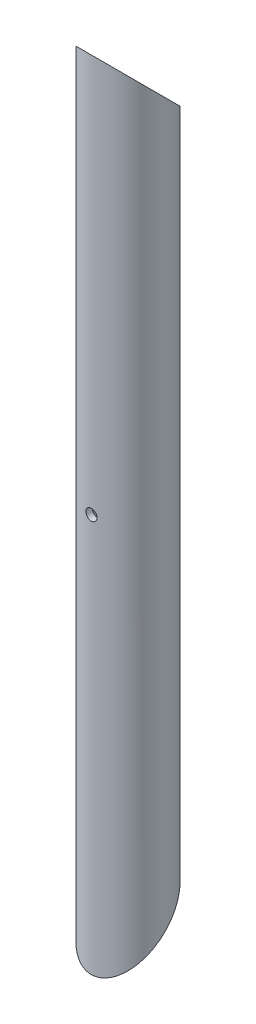
ISO-10303-21;
HEADER;
FILE_DESCRIPTION(('STEP AP214'),'2;1');
FILE_NAME('part.step','',(''),(''),'','','');
FILE_SCHEMA(('AUTOMOTIVE_DESIGN { 1 0 10303 214 1 1 1 1 }'));
ENDSEC;
DATA;
#1=APPLICATION_CONTEXT('core data for automotive mechanical design processes');
#2=APPLICATION_PROTOCOL_DEFINITION('international standard','automotive_design',2000,#1);
#3=PRODUCT_CONTEXT('',#1,'mechanical');
#4=PRODUCT('Part','Part','',(#3));
#5=PRODUCT_RELATED_PRODUCT_CATEGORY('part','',(#4));
#6=PRODUCT_DEFINITION_FORMATION('','',#4);
#7=PRODUCT_DEFINITION_CONTEXT('part definition',#1,'design');
#8=PRODUCT_DEFINITION('design','',#6,#7);
#9=PRODUCT_DEFINITION_SHAPE('','',#8);
#10=(LENGTH_UNIT() NAMED_UNIT(*) SI_UNIT(.MILLI.,.METRE.));
#11=(NAMED_UNIT(*) PLANE_ANGLE_UNIT() SI_UNIT($,.RADIAN.));
#12=(NAMED_UNIT(*) SI_UNIT($,.STERADIAN.) SOLID_ANGLE_UNIT());
#13=UNCERTAINTY_MEASURE_WITH_UNIT(LENGTH_MEASURE(1.E-05),#10,'distance_accuracy_value','');
#14=(GEOMETRIC_REPRESENTATION_CONTEXT(3) GLOBAL_UNCERTAINTY_ASSIGNED_CONTEXT((#13)) GLOBAL_UNIT_ASSIGNED_CONTEXT((#10,
#11,#12)) REPRESENTATION_CONTEXT('',''));
#15=CARTESIAN_POINT('',(0.,0.,0.));
#16=DIRECTION('',(0.,0.,1.));
#17=DIRECTION('',(1.,0.,0.));
#18=AXIS2_PLACEMENT_3D('',#15,#16,#17);
#19=CARTESIAN_POINT('',(0.,0.,25.328685172889));
#20=DIRECTION('',(0.,0.,-1.));
#21=DIRECTION('',(-1.,0.,0.));
#22=AXIS2_PLACEMENT_3D('',#19,#20,#21);
#23=CYLINDRICAL_SURFACE('',#22,3.175);
#24=CARTESIAN_POINT('',(-3.175,0.,-17.23601029821));
#25=CARTESIAN_POINT('',(-3.17499170563531,-0.176586329711993,-17.2360142025325));
#26=CARTESIAN_POINT('',(-3.160204980193,-0.353395647303662,-17.2387559605123));
#27=CARTESIAN_POINT('',(-3.10144620326743,-0.702172822919111,-17.2494221344825));
#28=CARTESIAN_POINT('',(-3.05741542075668,-0.874130210827916,-17.2573569793129));
#29=CARTESIAN_POINT('',(-2.94155418319512,-1.20790336169084,-17.2774814849624));
#30=CARTESIAN_POINT('',(-2.86976099295669,-1.36973238283411,-17.2896654401602));
#31=CARTESIAN_POINT('',(-2.70049958136209,-1.67898818960269,-17.3169076516439));
#32=CARTESIAN_POINT('',(-2.60304041137862,-1.82642002746643,-17.3319648941208));
#33=CARTESIAN_POINT('',(-2.38398457575559,-2.10449400464466,-17.3634567981395));
#34=CARTESIAN_POINT('',(-2.26214475966255,-2.23494319112389,-17.3799042842116));
#35=CARTESIAN_POINT('',(-1.9983060890961,-2.47367216439063,-17.4122106641685));
#36=CARTESIAN_POINT('',(-1.85630490149774,-2.5819493818351,-17.4280694896638));
#37=CARTESIAN_POINT('',(-1.5549329973674,-2.7739779431867,-17.4575458930296));
#38=CARTESIAN_POINT('',(-1.39544654247049,-2.85755041975943,-17.4711468271669));
#39=CARTESIAN_POINT('',(-1.06441137004706,-2.99664457625408,-17.4944334348895));
#40=CARTESIAN_POINT('',(-0.892863683139404,-3.05216864957038,-17.5041194425249));
#41=CARTESIAN_POINT('',(-0.544551877693409,-3.13300235226246,-17.5183953788483));
#42=CARTESIAN_POINT('',(-0.367864666154998,-3.15863364079218,-17.5230395218582));
#43=CARTESIAN_POINT('',(-0.0126405077397921,-3.17995577747868,-17.5268951402026));
#44=CARTESIAN_POINT('',(0.165896293571711,-3.17564896419808,-17.5261070398673));
#45=CARTESIAN_POINT('',(0.517545980754429,-3.13746523320548,-17.5192295190436));
#46=CARTESIAN_POINT('',(0.69069788570166,-3.10393485546927,-17.5132022283331));
#47=CARTESIAN_POINT('',(1.02887770129972,-3.00880264919223,-17.4965930267836));
#48=CARTESIAN_POINT('',(1.19390526609729,-2.94719962674158,-17.4860109222327));
#49=CARTESIAN_POINT('',(1.51216857737112,-2.79733388448749,-17.4613762385925));
#50=CARTESIAN_POINT('',(1.6653365929941,-2.70893044981589,-17.4473054148844));
#51=CARTESIAN_POINT('',(1.95478234852334,-2.50808391181308,-17.4172531348575));
#52=CARTESIAN_POINT('',(2.09105975689984,-2.3956403367387,-17.401271641048));
#53=CARTESIAN_POINT('',(2.34489710940459,-2.14801379502275,-17.3689022843395));
#54=CARTESIAN_POINT('',(2.4621651457909,-2.0125317791667,-17.352511870706));
#55=CARTESIAN_POINT('',(2.67240803396032,-1.7235970007153,-17.3213812233656));
#56=CARTESIAN_POINT('',(2.76537201617291,-1.57013624171481,-17.3066417296829));
#57=CARTESIAN_POINT('',(2.92443648471675,-1.24918627948011,-17.2804770196812));
#58=CARTESIAN_POINT('',(2.99047482913785,-1.0816656889827,-17.2690594873294));
#59=CARTESIAN_POINT('',(3.09325605413548,-0.737872419730787,-17.2509480784607));
#60=CARTESIAN_POINT('',(3.13006076603486,-0.561619055398518,-17.244244235605));
#61=CARTESIAN_POINT('',(3.15948139210758,-0.320051085290951,-17.2388627057127));
#62=CARTESIAN_POINT('',(3.16529604707456,-0.256192453007514,-17.2377954780037));
#63=CARTESIAN_POINT('',(3.17305685965037,-0.128232350837918,-17.236368564829));
#64=CARTESIAN_POINT('',(3.17500301226552,-0.0641308806383967,-17.2360088802766));
#65=CARTESIAN_POINT('',(3.17499170563531,0.176586329711993,-17.2360142025325));
#66=CARTESIAN_POINT('',(3.160204980193,0.353395647303662,-17.2387559605123));
#67=CARTESIAN_POINT('',(3.10144620326743,0.70217282291911,-17.2494221344825));
#68=CARTESIAN_POINT('',(3.05741542075668,0.874130210827915,-17.2573569793129));
#69=CARTESIAN_POINT('',(2.94155418319512,1.20790336169084,-17.2774814849624));
#70=CARTESIAN_POINT('',(2.86976099295669,1.36973238283411,-17.2896654401602));
#71=CARTESIAN_POINT('',(2.70049958136209,1.67898818960269,-17.3169076516439));
#72=CARTESIAN_POINT('',(2.60304041137862,1.82642002746643,-17.3319648941208));
#73=CARTESIAN_POINT('',(2.38398457575559,2.10449400464466,-17.3634567981395));
#74=CARTESIAN_POINT('',(2.26214475966255,2.23494319112389,-17.3799042842116));
#75=CARTESIAN_POINT('',(1.9983060890961,2.47367216439063,-17.4122106641685));
#76=CARTESIAN_POINT('',(1.85630490149774,2.5819493818351,-17.4280694896638));
#77=CARTESIAN_POINT('',(1.5549329973674,2.7739779431867,-17.4575458930296));
#78=CARTESIAN_POINT('',(1.39544654247049,2.85755041975943,-17.4711468271669));
#79=CARTESIAN_POINT('',(1.06441137004706,2.99664457625408,-17.4944334348895));
#80=CARTESIAN_POINT('',(0.892863683139404,3.05216864957038,-17.5041194425249));
#81=CARTESIAN_POINT('',(0.544551877693409,3.13300235226246,-17.5183953788483));
#82=CARTESIAN_POINT('',(0.367864666154998,3.15863364079218,-17.5230395218582));
#83=CARTESIAN_POINT('',(0.0126405077397924,3.17995577747868,-17.5268951402026));
#84=CARTESIAN_POINT('',(-0.165896293571711,3.17564896419808,-17.5261070398673));
#85=CARTESIAN_POINT('',(-0.517545980754429,3.13746523320548,-17.5192295190436));
#86=CARTESIAN_POINT('',(-0.690697885701659,3.10393485546927,-17.5132022283331));
#87=CARTESIAN_POINT('',(-1.02887770129972,3.00880264919223,-17.4965930267836));
#88=CARTESIAN_POINT('',(-1.19390526609729,2.94719962674158,-17.4860109222327));
#89=CARTESIAN_POINT('',(-1.51216857737112,2.79733388448749,-17.4613762385925));
#90=CARTESIAN_POINT('',(-1.6653365929941,2.70893044981589,-17.4473054148844));
#91=CARTESIAN_POINT('',(-1.95478234852334,2.50808391181308,-17.4172531348575));
#92=CARTESIAN_POINT('',(-2.09105975689984,2.3956403367387,-17.401271641048));
#93=CARTESIAN_POINT('',(-2.34489710940459,2.14801379502275,-17.3689022843395));
#94=CARTESIAN_POINT('',(-2.4621651457909,2.0125317791667,-17.352511870706));
#95=CARTESIAN_POINT('',(-2.67240803396032,1.7235970007153,-17.3213812233656));
#96=CARTESIAN_POINT('',(-2.76537201617291,1.57013624171481,-17.3066417296829));
#97=CARTESIAN_POINT('',(-2.92443648471675,1.24918627948012,-17.2804770196812));
#98=CARTESIAN_POINT('',(-2.99047482913785,1.0816656889827,-17.2690594873294));
#99=CARTESIAN_POINT('',(-3.09325605413548,0.737872419730787,-17.2509480784607));
#100=CARTESIAN_POINT('',(-3.13006076603486,0.561619055398519,-17.244244235605));
#101=CARTESIAN_POINT('',(-3.15948139210758,0.32005108529095,-17.2388627057127));
#102=CARTESIAN_POINT('',(-3.16529604707456,0.256192453007514,-17.2377954780037));
#103=CARTESIAN_POINT('',(-3.17305685965037,0.128232350837918,-17.236368564829));
#104=CARTESIAN_POINT('',(-3.17500301226552,0.0641308806383965,-17.2360088802766));
#105=CARTESIAN_POINT('',(-3.175,0.,-17.23601029821));
#106=B_SPLINE_CURVE_WITH_KNOTS('',3,(#24,#25,#26,#27,#28,#29,#30,#31,#32,#33,#34,#35,#36,#37,
#38,#39,#40,#41,#42,#43,#44,#45,#46,#47,#48,#49,#50,#51,#52,#53,#54,#55,#56,#57,#58,#59,#60,#61,
#62,#63,#64,#65,#66,#67,#68,#69,#70,#71,#72,#73,#74,#75,#76,#77,#78,#79,#80,#81,#82,#83,#84,#85,
#86,#87,#88,#89,#90,#91,#92,#93,#94,#95,#96,#97,#98,#99,#100,#101,#102,#103,#104,#105),
.UNSPECIFIED.,.T.,.F.,(4,2,2,2,2,2,2,2,2,2,2,2,2,2,2,2,2,2,2,2,2,2,2,2,2,2,2,2,2,2,2,2,2,2,2,2,
2,2,2,2,4),(0.,0.529513888774739,1.0600944322977,1.58996524863779,2.11964945021935,
2.65490616569006,3.19022487298483,3.72932945830094,4.26838803358483,4.8015909687849,
5.33475225423544,5.86167590853889,6.38862197462633,6.91838413625488,7.44815669443773,
7.98542013207565,8.52292344208854,9.06166033290218,9.59925469781341,9.79155807836205,
9.98386170714674,10.5133755959215,11.0439561394444,11.5738269557845,12.1035111573661,
12.6387678728368,13.1740865801316,13.7131911654477,14.2522497407316,14.7854526759316,
15.3186139613822,15.8455376156856,16.3724836817731,16.9022458434016,17.4320184015845,
17.9692818392224,18.5067851492353,19.0455220400489,19.5831164049602,19.7754197855088,
19.9677234142935),.UNSPECIFIED.);
#107=CARTESIAN_POINT('',(-3.175,0.,-17.23601029821));
#108=VERTEX_POINT('',#107);
#109=EDGE_CURVE('E18',#108,#108,#106,.T.);
#110=ORIENTED_EDGE('',*,*,#109,.T.);
#111=EDGE_LOOP('',(#110));
#112=FACE_BOUND('',#111,.T.);
#113=CARTESIAN_POINT('',(3.175,0.,-20.8415474233561));
#114=CARTESIAN_POINT('',(3.17499198153614,0.177084018009693,-20.841550570963));
#115=CARTESIAN_POINT('',(3.16012244295638,0.354396605066482,-20.8438306663304));
#116=CARTESIAN_POINT('',(3.10101874080881,0.704192750806675,-20.8527040450184));
#117=CARTESIAN_POINT('',(3.05672431568941,0.87666564082655,-20.85930617938));
#118=CARTESIAN_POINT('',(2.94012163446245,1.21147677341699,-20.876059336013));
#119=CARTESIAN_POINT('',(2.86784653303954,1.37382674741245,-20.886206156753));
#120=CARTESIAN_POINT('',(2.69740599554678,1.6840261412223,-20.9088995414036));
#121=CARTESIAN_POINT('',(2.59925063787972,1.83188117503907,-20.9214451706382));
#122=CARTESIAN_POINT('',(2.37896968509168,2.11017717524291,-20.947639110701));
#123=CARTESIAN_POINT('',(2.25667392977481,2.24048278519243,-20.9612948191984));
#124=CARTESIAN_POINT('',(1.99194559724344,2.47881081823414,-20.9881047967098));
#125=CARTESIAN_POINT('',(1.84951088719048,2.58683087816676,-21.0012590124251));
#126=CARTESIAN_POINT('',(1.5477002624607,2.77800435774252,-21.0256591780941));
#127=CARTESIAN_POINT('',(1.38824594400147,2.86103531695666,-21.0368956172459));
#128=CARTESIAN_POINT('',(1.05745854217628,2.99908665846758,-21.0561136072835));
#129=CARTESIAN_POINT('',(0.886126195416483,3.05410877594737,-21.0640953597952));
#130=CARTESIAN_POINT('',(0.537819507579906,3.13417697021133,-21.07585334209));
#131=CARTESIAN_POINT('',(0.36089761922799,3.15944654588681,-21.0796609129062));
#132=CARTESIAN_POINT('',(0.00528635041266461,3.17998633890252,-21.0827489482678));
#133=CARTESIAN_POINT('',(-0.173402933515662,3.1752581857816,-21.0820296587217));
#134=CARTESIAN_POINT('',(-0.525949789310128,3.13611312249602,-21.076170060675));
#135=CARTESIAN_POINT('',(-0.699834769386914,3.10193692691584,-21.0710655985168));
#136=CARTESIAN_POINT('',(-1.03937474503867,3.00524329517621,-21.0570490788488));
#137=CARTESIAN_POINT('',(-1.20502945779485,2.94272488583236,-21.048136890594));
#138=CARTESIAN_POINT('',(-1.52413828061928,2.79087293143009,-21.0274443893832));
#139=CARTESIAN_POINT('',(-1.67754305142225,2.70143724767826,-21.015653184629));
#140=CARTESIAN_POINT('',(-1.96724611548321,2.49837158811199,-20.9905178852117));
#141=CARTESIAN_POINT('',(-2.10354461967399,2.3847419106738,-20.9771738097005));
#142=CARTESIAN_POINT('',(-2.35657505297964,2.13519564150819,-20.9502662585847));
#143=CARTESIAN_POINT('',(-2.47310374178558,1.9990729975376,-20.9367019114556));
#144=CARTESIAN_POINT('',(-2.68174901209259,1.70902531345366,-20.9110027940947));
#145=CARTESIAN_POINT('',(-2.7738545302352,1.55509225066124,-20.8988686731134));
#146=CARTESIAN_POINT('',(-2.93105862601613,1.23353931809687,-20.8774028453063));
#147=CARTESIAN_POINT('',(-2.99611389281517,1.06589800925963,-20.8680756392477));
#148=CARTESIAN_POINT('',(-3.09695534061537,0.722119803337998,-20.8533505483862));
#149=CARTESIAN_POINT('',(-3.13280341719517,0.546001714013523,-20.8479443568951));
#150=CARTESIAN_POINT('',(-3.16070559060224,0.307196959759597,-20.8437206395775));
#151=CARTESIAN_POINT('',(-3.16606178486996,0.245890519962392,-20.8429074334073));
#152=CARTESIAN_POINT('',(-3.17321038429624,0.123065256838801,-20.8418202781168));
#153=CARTESIAN_POINT('',(-3.17500278685709,0.0615464333576373,-20.8415463293896));
#154=CARTESIAN_POINT('',(-3.17499198153614,-0.177084018009693,-20.841550570963));
#155=CARTESIAN_POINT('',(-3.16012244295638,-0.354396605066482,-20.8438306663304));
#156=CARTESIAN_POINT('',(-3.10101874080881,-0.704192750806674,-20.8527040450184));
#157=CARTESIAN_POINT('',(-3.05672431568941,-0.876665640826549,-20.85930617938));
#158=CARTESIAN_POINT('',(-2.94012163446245,-1.21147677341699,-20.876059336013));
#159=CARTESIAN_POINT('',(-2.86784653303954,-1.37382674741245,-20.886206156753));
#160=CARTESIAN_POINT('',(-2.69740599554678,-1.6840261412223,-20.9088995414036));
#161=CARTESIAN_POINT('',(-2.59925063787972,-1.83188117503907,-20.9214451706382));
#162=CARTESIAN_POINT('',(-2.37896968509168,-2.11017717524291,-20.947639110701));
#163=CARTESIAN_POINT('',(-2.25667392977481,-2.24048278519243,-20.9612948191984));
#164=CARTESIAN_POINT('',(-1.99194559724344,-2.47881081823414,-20.9881047967098));
#165=CARTESIAN_POINT('',(-1.84951088719048,-2.58683087816676,-21.0012590124251));
#166=CARTESIAN_POINT('',(-1.5477002624607,-2.77800435774252,-21.0256591780941));
#167=CARTESIAN_POINT('',(-1.38824594400147,-2.86103531695666,-21.0368956172459));
#168=CARTESIAN_POINT('',(-1.05745854217628,-2.99908665846758,-21.0561136072835));
#169=CARTESIAN_POINT('',(-0.886126195416483,-3.05410877594737,-21.0640953597952));
#170=CARTESIAN_POINT('',(-0.537819507579906,-3.13417697021133,-21.07585334209));
#171=CARTESIAN_POINT('',(-0.36089761922799,-3.15944654588681,-21.0796609129062));
#172=CARTESIAN_POINT('',(-0.00528635041266467,-3.17998633890252,-21.0827489482678));
#173=CARTESIAN_POINT('',(0.173402933515662,-3.1752581857816,-21.0820296587217));
#174=CARTESIAN_POINT('',(0.525949789310128,-3.13611312249602,-21.076170060675));
#175=CARTESIAN_POINT('',(0.699834769386914,-3.10193692691584,-21.0710655985168));
#176=CARTESIAN_POINT('',(1.03937474503867,-3.00524329517621,-21.0570490788488));
#177=CARTESIAN_POINT('',(1.20502945779485,-2.94272488583236,-21.048136890594));
#178=CARTESIAN_POINT('',(1.52413828061928,-2.7908729314301,-21.0274443893832));
#179=CARTESIAN_POINT('',(1.67754305142225,-2.70143724767826,-21.015653184629));
#180=CARTESIAN_POINT('',(1.96724611548321,-2.49837158811199,-20.9905178852117));
#181=CARTESIAN_POINT('',(2.10354461967399,-2.3847419106738,-20.9771738097005));
#182=CARTESIAN_POINT('',(2.35657505297964,-2.13519564150819,-20.9502662585847));
#183=CARTESIAN_POINT('',(2.47310374178558,-1.9990729975376,-20.9367019114556));
#184=CARTESIAN_POINT('',(2.68174901209259,-1.70902531345366,-20.9110027940947));
#185=CARTESIAN_POINT('',(2.7738545302352,-1.55509225066124,-20.8988686731134));
#186=CARTESIAN_POINT('',(2.93105862601613,-1.23353931809687,-20.8774028453063));
#187=CARTESIAN_POINT('',(2.99611389281517,-1.06589800925963,-20.8680756392477));
#188=CARTESIAN_POINT('',(3.09695534061537,-0.722119803338,-20.8533505483862));
#189=CARTESIAN_POINT('',(3.13280341719517,-0.546001714013524,-20.8479443568951));
#190=CARTESIAN_POINT('',(3.16070559060224,-0.307196959759597,-20.8437206395775));
#191=CARTESIAN_POINT('',(3.16606178486996,-0.245890519962391,-20.8429074334073));
#192=CARTESIAN_POINT('',(3.17321038429624,-0.1230652568388,-20.8418202781168));
#193=CARTESIAN_POINT('',(3.17500278685709,-0.061546433357637,-20.8415463293896));
#194=CARTESIAN_POINT('',(3.175,0.,-20.8415474233561));
#195=B_SPLINE_CURVE_WITH_KNOTS('',3,(#113,#114,#115,#116,#117,#118,#119,#120,#121,#122,#123,
#124,#125,#126,#127,#128,#129,#130,#131,#132,#133,#134,#135,#136,#137,#138,#139,#140,#141,#142,
#143,#144,#145,#146,#147,#148,#149,#150,#151,#152,#153,#154,#155,#156,#157,#158,#159,#160,#161,
#162,#163,#164,#165,#166,#167,#168,#169,#170,#171,#172,#173,#174,#175,#176,#177,#178,#179,#180,
#181,#182,#183,#184,#185,#186,#187,#188,#189,#190,#191,#192,#193,#194),.UNSPECIFIED.,.T.,.F.,(4,
2,2,2,2,2,2,2,2,2,2,2,2,2,2,2,2,2,2,2,2,2,2,2,2,2,2,2,2,2,2,2,2,2,2,2,2,2,2,2,4),(0.,
0.531017217058499,1.06312531282767,1.59460482675656,2.1258776745103,2.66103843647724,
3.19625591775302,3.73405508207708,4.27182092500967,4.80552080174594,5.33919168704614,
5.86854117501221,6.39790884058728,6.9293110960498,7.46070679828973,7.99727187477794,
8.53407959420501,9.07174353080151,9.60826506994209,9.79282261672791,9.97738029804085,
10.5083975150994,11.0405056108685,11.5719851247974,12.1032579725512,12.6384187345181,
13.1736362157939,13.7114353801179,14.2492012230505,14.7829010997868,15.316571985087,
15.8459214730531,16.3752891386281,16.9066913940906,17.4380870963306,17.9746521728188,
18.5114598922459,19.0491238288424,19.5856453679829,19.7702029147688,19.9547605960817),.UNSPECIFIED.);
#196=CARTESIAN_POINT('',(3.175,0.,-20.8415474233561));
#197=VERTEX_POINT('',#196);
#198=EDGE_CURVE('E45',#197,#197,#195,.T.);
#199=ORIENTED_EDGE('',*,*,#198,.F.);
#200=EDGE_LOOP('',(#199));
#201=FACE_BOUND('',#200,.T.);
#202=ADVANCED_FACE('F14',(#112,#201),#23,.F.);
#203=CARTESIAN_POINT('',(0.,-227.457,0.));
#204=DIRECTION('',(0.,1.,0.));
#205=DIRECTION('',(0.,0.,1.));
#206=AXIS2_PLACEMENT_3D('',#203,#204,#205);
#207=CYLINDRICAL_SURFACE('',#206,17.526);
#208=CARTESIAN_POINT('',(0.,206.375,0.));
#209=DIRECTION('',(0.,-0.707106781186548,0.707106781186548));
#210=DIRECTION('',(0.,0.707106781186548,0.707106781186548));
#211=AXIS2_PLACEMENT_3D('',#208,#209,#210);
#212=ELLIPSE('',#211,24.7855068941509,17.526);
#213=CARTESIAN_POINT('',(0.,223.901,17.526));
#214=VERTEX_POINT('',#213);
#215=EDGE_CURVE('E51',#214,#214,#212,.F.);
#216=ORIENTED_EDGE('',*,*,#215,.T.);
#217=EDGE_LOOP('',(#216));
#218=FACE_BOUND('',#217,.T.);
#219=CARTESIAN_POINT('',(3.175,0.,17.23601029821));
#220=CARTESIAN_POINT('',(3.17499170563531,0.176586329711993,17.2360142025325));
#221=CARTESIAN_POINT('',(3.160204980193,0.353395647303663,17.2387559605123));
#222=CARTESIAN_POINT('',(3.10144620326743,0.702172822919111,17.2494221344825));
#223=CARTESIAN_POINT('',(3.05741542075668,0.874130210827916,17.2573569793129));
#224=CARTESIAN_POINT('',(2.94155418319512,1.20790336169084,17.2774814849624));
#225=CARTESIAN_POINT('',(2.86976099295669,1.36973238283411,17.2896654401602));
#226=CARTESIAN_POINT('',(2.70049958136209,1.67898818960269,17.3169076516439));
#227=CARTESIAN_POINT('',(2.60304041137862,1.82642002746643,17.3319648941208));
#228=CARTESIAN_POINT('',(2.38398457575559,2.10449400464466,17.3634567981395));
#229=CARTESIAN_POINT('',(2.26214475966255,2.23494319112389,17.3799042842116));
#230=CARTESIAN_POINT('',(1.9983060890961,2.47367216439063,17.4122106641685));
#231=CARTESIAN_POINT('',(1.85630490149774,2.5819493818351,17.4280694896638));
#232=CARTESIAN_POINT('',(1.5549329973674,2.7739779431867,17.4575458930296));
#233=CARTESIAN_POINT('',(1.39544654247049,2.85755041975943,17.4711468271669));
#234=CARTESIAN_POINT('',(1.06441137004706,2.99664457625408,17.4944334348895));
#235=CARTESIAN_POINT('',(0.892863683139404,3.05216864957038,17.5041194425249));
#236=CARTESIAN_POINT('',(0.544551877693409,3.13300235226246,17.5183953788483));
#237=CARTESIAN_POINT('',(0.367864666154998,3.15863364079218,17.5230395218582));
#238=CARTESIAN_POINT('',(0.0126405077397921,3.17995577747868,17.5268951402026));
#239=CARTESIAN_POINT('',(-0.165896293571711,3.17564896419808,17.5261070398673));
#240=CARTESIAN_POINT('',(-0.517545980754429,3.13746523320548,17.5192295190436));
#241=CARTESIAN_POINT('',(-0.69069788570166,3.10393485546927,17.5132022283331));
#242=CARTESIAN_POINT('',(-1.02887770129972,3.00880264919223,17.4965930267836));
#243=CARTESIAN_POINT('',(-1.19390526609729,2.94719962674158,17.4860109222327));
#244=CARTESIAN_POINT('',(-1.51216857737112,2.79733388448749,17.4613762385925));
#245=CARTESIAN_POINT('',(-1.6653365929941,2.70893044981589,17.4473054148844));
#246=CARTESIAN_POINT('',(-1.95478234852334,2.50808391181308,17.4172531348575));
#247=CARTESIAN_POINT('',(-2.09105975689984,2.3956403367387,17.401271641048));
#248=CARTESIAN_POINT('',(-2.34489710940459,2.14801379502275,17.3689022843395));
#249=CARTESIAN_POINT('',(-2.4621651457909,2.0125317791667,17.352511870706));
#250=CARTESIAN_POINT('',(-2.67240803396032,1.7235970007153,17.3213812233656));
#251=CARTESIAN_POINT('',(-2.76537201617291,1.57013624171481,17.3066417296829));
#252=CARTESIAN_POINT('',(-2.92443648471675,1.24918627948011,17.2804770196812));
#253=CARTESIAN_POINT('',(-2.99047482913785,1.0816656889827,17.2690594873294));
#254=CARTESIAN_POINT('',(-3.09325605413548,0.737872419730787,17.2509480784607));
#255=CARTESIAN_POINT('',(-3.13006076603486,0.561619055398518,17.244244235605));
#256=CARTESIAN_POINT('',(-3.15948139210758,0.320051085290951,17.2388627057127));
#257=CARTESIAN_POINT('',(-3.16529604707456,0.256192453007514,17.2377954780037));
#258=CARTESIAN_POINT('',(-3.17305685965037,0.128232350837919,17.236368564829));
#259=CARTESIAN_POINT('',(-3.17500301226552,0.0641308806383968,17.2360088802766));
#260=CARTESIAN_POINT('',(-3.17499170563531,-0.176586329711992,17.2360142025325));
#261=CARTESIAN_POINT('',(-3.160204980193,-0.353395647303662,17.2387559605123));
#262=CARTESIAN_POINT('',(-3.10144620326743,-0.70217282291911,17.2494221344825));
#263=CARTESIAN_POINT('',(-3.05741542075668,-0.874130210827915,17.2573569793129));
#264=CARTESIAN_POINT('',(-2.94155418319512,-1.20790336169084,17.2774814849624));
#265=CARTESIAN_POINT('',(-2.86976099295669,-1.36973238283411,17.2896654401602));
#266=CARTESIAN_POINT('',(-2.70049958136209,-1.67898818960269,17.3169076516439));
#267=CARTESIAN_POINT('',(-2.60304041137862,-1.82642002746643,17.3319648941208));
#268=CARTESIAN_POINT('',(-2.38398457575559,-2.10449400464466,17.3634567981395));
#269=CARTESIAN_POINT('',(-2.26214475966255,-2.23494319112389,17.3799042842116));
#270=CARTESIAN_POINT('',(-1.9983060890961,-2.47367216439063,17.4122106641685));
#271=CARTESIAN_POINT('',(-1.85630490149774,-2.5819493818351,17.4280694896638));
#272=CARTESIAN_POINT('',(-1.5549329973674,-2.7739779431867,17.4575458930296));
#273=CARTESIAN_POINT('',(-1.39544654247049,-2.85755041975943,17.4711468271669));
#274=CARTESIAN_POINT('',(-1.06441137004706,-2.99664457625408,17.4944334348895));
#275=CARTESIAN_POINT('',(-0.892863683139404,-3.05216864957038,17.5041194425249));
#276=CARTESIAN_POINT('',(-0.544551877693409,-3.13300235226246,17.5183953788483));
#277=CARTESIAN_POINT('',(-0.367864666154998,-3.15863364079218,17.5230395218582));
#278=CARTESIAN_POINT('',(-0.0126405077397924,-3.17995577747868,17.5268951402026));
#279=CARTESIAN_POINT('',(0.165896293571711,-3.17564896419808,17.5261070398673));
#280=CARTESIAN_POINT('',(0.517545980754429,-3.13746523320548,17.5192295190436));
#281=CARTESIAN_POINT('',(0.690697885701659,-3.10393485546927,17.5132022283331));
#282=CARTESIAN_POINT('',(1.02887770129972,-3.00880264919223,17.4965930267836));
#283=CARTESIAN_POINT('',(1.19390526609729,-2.94719962674158,17.4860109222327));
#284=CARTESIAN_POINT('',(1.51216857737112,-2.79733388448749,17.4613762385925));
#285=CARTESIAN_POINT('',(1.6653365929941,-2.70893044981589,17.4473054148844));
#286=CARTESIAN_POINT('',(1.95478234852334,-2.50808391181308,17.4172531348575));
#287=CARTESIAN_POINT('',(2.09105975689984,-2.3956403367387,17.401271641048));
#288=CARTESIAN_POINT('',(2.34489710940459,-2.14801379502275,17.3689022843395));
#289=CARTESIAN_POINT('',(2.4621651457909,-2.0125317791667,17.352511870706));
#290=CARTESIAN_POINT('',(2.67240803396032,-1.7235970007153,17.3213812233656));
#291=CARTESIAN_POINT('',(2.76537201617291,-1.57013624171481,17.3066417296829));
#292=CARTESIAN_POINT('',(2.92443648471675,-1.24918627948012,17.2804770196812));
#293=CARTESIAN_POINT('',(2.99047482913785,-1.0816656889827,17.2690594873294));
#294=CARTESIAN_POINT('',(3.09325605413548,-0.737872419730787,17.2509480784607));
#295=CARTESIAN_POINT('',(3.13006076603486,-0.561619055398519,17.244244235605));
#296=CARTESIAN_POINT('',(3.15948139210758,-0.32005108529095,17.2388627057127));
#297=CARTESIAN_POINT('',(3.16529604707456,-0.256192453007514,17.2377954780037));
#298=CARTESIAN_POINT('',(3.17305685965037,-0.128232350837918,17.236368564829));
#299=CARTESIAN_POINT('',(3.17500301226552,-0.0641308806383964,17.2360088802766));
#300=CARTESIAN_POINT('',(3.175,0.,17.23601029821));
#301=B_SPLINE_CURVE_WITH_KNOTS('',3,(#219,#220,#221,#222,#223,#224,#225,#226,#227,#228,#229,
#230,#231,#232,#233,#234,#235,#236,#237,#238,#239,#240,#241,#242,#243,#244,#245,#246,#247,#248,
#249,#250,#251,#252,#253,#254,#255,#256,#257,#258,#259,#260,#261,#262,#263,#264,#265,#266,#267,
#268,#269,#270,#271,#272,#273,#274,#275,#276,#277,#278,#279,#280,#281,#282,#283,#284,#285,#286,
#287,#288,#289,#290,#291,#292,#293,#294,#295,#296,#297,#298,#299,#300),.UNSPECIFIED.,.T.,.F.,(4,
2,2,2,2,2,2,2,2,2,2,2,2,2,2,2,2,2,2,2,2,2,2,2,2,2,2,2,2,2,2,2,2,2,2,2,2,2,2,2,4),(0.,
0.529513888774739,1.0600944322977,1.58996524863779,2.11964945021935,2.65490616569005,
3.19022487298483,3.72932945830094,4.26838803358483,4.8015909687849,5.33475225423544,
5.86167590853889,6.38862197462633,6.91838413625488,7.44815669443773,7.98542013207565,
8.52292344208854,9.06166033290218,9.59925469781341,9.79155807836205,9.98386170714674,
10.5133755959215,11.0439561394444,11.5738269557845,12.1035111573661,12.6387678728368,
13.1740865801316,13.7131911654477,14.2522497407316,14.7854526759316,15.3186139613822,
15.8455376156856,16.3724836817731,16.9022458434016,17.4320184015845,17.9692818392224,
18.5067851492353,19.0455220400489,19.5831164049602,19.7754197855088,19.9677234142935),.UNSPECIFIED.);
#302=CARTESIAN_POINT('',(3.175,0.,17.23601029821));
#303=VERTEX_POINT('',#302);
#304=EDGE_CURVE('E75',#303,#303,#301,.T.);
#305=ORIENTED_EDGE('',*,*,#304,.T.);
#306=EDGE_LOOP('',(#305));
#307=FACE_BOUND('',#306,.T.);
#308=CARTESIAN_POINT('',(0.,-206.375,0.));
#309=DIRECTION('',(0.,0.707106781186548,0.707106781186548));
#310=DIRECTION('',(0.,0.707106781186548,-0.707106781186548));
#311=AXIS2_PLACEMENT_3D('',#308,#309,#310);
#312=ELLIPSE('',#311,24.7855068941509,17.526);
#313=CARTESIAN_POINT('',(0.,-188.849,-17.526));
#314=VERTEX_POINT('',#313);
#315=EDGE_CURVE('E50',#314,#314,#312,.F.);
#316=ORIENTED_EDGE('',*,*,#315,.T.);
#317=EDGE_LOOP('',(#316));
#318=FACE_BOUND('',#317,.T.);
#319=ORIENTED_EDGE('',*,*,#109,.F.);
#320=EDGE_LOOP('',(#319));
#321=FACE_BOUND('',#320,.T.);
#322=ADVANCED_FACE('F61',(#218,#307,#318,#321),#207,.F.);
#323=CARTESIAN_POINT('',(-25.2984,227.457,21.082));
#324=DIRECTION('',(0.,-0.707106781186548,0.707106781186548));
#325=DIRECTION('',(0.,-0.707106781186548,-0.707106781186548));
#326=AXIS2_PLACEMENT_3D('',#323,#324,#325);
#327=PLANE('',#326);
#328=ORIENTED_EDGE('',*,*,#215,.F.);
#329=EDGE_LOOP('',(#328));
#330=FACE_BOUND('',#329,.T.);
#331=CARTESIAN_POINT('',(0.,206.375,0.));
#332=DIRECTION('',(0.,-0.707106781186548,0.707106781186548));
#333=DIRECTION('',(0.,0.707106781186548,0.707106781186548));
#334=AXIS2_PLACEMENT_3D('',#331,#332,#333);
#335=ELLIPSE('',#334,29.8144503219496,21.082);
#336=CARTESIAN_POINT('',(0.,227.457,21.082));
#337=VERTEX_POINT('',#336);
#338=EDGE_CURVE('E29',#337,#337,#335,.T.);
#339=ORIENTED_EDGE('',*,*,#338,.F.);
#340=EDGE_LOOP('',(#339));
#341=FACE_BOUND('',#340,.T.);
#342=ADVANCED_FACE('F63',(#330,#341),#327,.F.);
#343=CARTESIAN_POINT('',(25.2984,-185.293,-21.082));
#344=DIRECTION('',(0.,0.707106781186548,0.707106781186548));
#345=DIRECTION('',(0.,-0.707106781186548,0.707106781186548));
#346=AXIS2_PLACEMENT_3D('',#343,#344,#345);
#347=PLANE('',#346);
#348=ORIENTED_EDGE('',*,*,#315,.F.);
#349=EDGE_LOOP('',(#348));
#350=FACE_BOUND('',#349,.T.);
#351=CARTESIAN_POINT('',(0.,-206.375,0.));
#352=DIRECTION('',(0.,0.707106781186548,0.707106781186548));
#353=DIRECTION('',(0.,0.707106781186548,-0.707106781186548));
#354=AXIS2_PLACEMENT_3D('',#351,#352,#353);
#355=ELLIPSE('',#354,29.8144503219496,21.082);
#356=CARTESIAN_POINT('',(0.,-185.293,-21.082));
#357=VERTEX_POINT('',#356);
#358=EDGE_CURVE('E24',#357,#357,#355,.T.);
#359=ORIENTED_EDGE('',*,*,#358,.F.);
#360=EDGE_LOOP('',(#359));
#361=FACE_BOUND('',#360,.T.);
#362=ADVANCED_FACE('F69',(#350,#361),#347,.F.);
#363=CARTESIAN_POINT('',(0.,0.,25.328685172889));
#364=DIRECTION('',(0.,0.,-1.));
#365=DIRECTION('',(-1.,0.,0.));
#366=AXIS2_PLACEMENT_3D('',#363,#364,#365);
#367=CYLINDRICAL_SURFACE('',#366,3.175);
#368=ORIENTED_EDGE('',*,*,#304,.F.);
#369=EDGE_LOOP('',(#368));
#370=FACE_BOUND('',#369,.T.);
#371=CARTESIAN_POINT('',(3.175,0.,20.8415474233561));
#372=CARTESIAN_POINT('',(3.17499198153614,-0.177084018009693,20.841550570963));
#373=CARTESIAN_POINT('',(3.16012244295638,-0.354396605066482,20.8438306663304));
#374=CARTESIAN_POINT('',(3.10101874080881,-0.704192750806674,20.8527040450184));
#375=CARTESIAN_POINT('',(3.05672431568941,-0.876665640826549,20.85930617938));
#376=CARTESIAN_POINT('',(2.94012163446245,-1.21147677341699,20.876059336013));
#377=CARTESIAN_POINT('',(2.86784653303954,-1.37382674741245,20.886206156753));
#378=CARTESIAN_POINT('',(2.69740599554678,-1.6840261412223,20.9088995414036));
#379=CARTESIAN_POINT('',(2.59925063787972,-1.83188117503907,20.9214451706382));
#380=CARTESIAN_POINT('',(2.37896968509168,-2.11017717524291,20.947639110701));
#381=CARTESIAN_POINT('',(2.25667392977481,-2.24048278519242,20.9612948191984));
#382=CARTESIAN_POINT('',(1.99194559724344,-2.47881081823414,20.9881047967098));
#383=CARTESIAN_POINT('',(1.84951088719048,-2.58683087816676,21.0012590124251));
#384=CARTESIAN_POINT('',(1.54770026246071,-2.77800435774252,21.0256591780941));
#385=CARTESIAN_POINT('',(1.38824594400147,-2.86103531695666,21.0368956172459));
#386=CARTESIAN_POINT('',(1.05745854217628,-2.99908665846758,21.0561136072835));
#387=CARTESIAN_POINT('',(0.886126195416484,-3.05410877594737,21.0640953597952));
#388=CARTESIAN_POINT('',(0.537819507579906,-3.13417697021133,21.07585334209));
#389=CARTESIAN_POINT('',(0.360897619227991,-3.15944654588681,21.0796609129062));
#390=CARTESIAN_POINT('',(0.00528635041266518,-3.17998633890252,21.0827489482678));
#391=CARTESIAN_POINT('',(-0.173402933515661,-3.1752581857816,21.0820296587217));
#392=CARTESIAN_POINT('',(-0.525949789310127,-3.13611312249602,21.076170060675));
#393=CARTESIAN_POINT('',(-0.699834769386913,-3.10193692691584,21.0710655985168));
#394=CARTESIAN_POINT('',(-1.03937474503867,-3.00524329517621,21.0570490788488));
#395=CARTESIAN_POINT('',(-1.20502945779485,-2.94272488583236,21.048136890594));
#396=CARTESIAN_POINT('',(-1.52413828061928,-2.7908729314301,21.0274443893832));
#397=CARTESIAN_POINT('',(-1.67754305142225,-2.70143724767826,21.015653184629));
#398=CARTESIAN_POINT('',(-1.96724611548321,-2.49837158811199,20.9905178852117));
#399=CARTESIAN_POINT('',(-2.10354461967399,-2.3847419106738,20.9771738097005));
#400=CARTESIAN_POINT('',(-2.35657505297964,-2.13519564150819,20.9502662585847));
#401=CARTESIAN_POINT('',(-2.47310374178558,-1.9990729975376,20.9367019114556));
#402=CARTESIAN_POINT('',(-2.68174901209259,-1.70902531345366,20.9110027940947));
#403=CARTESIAN_POINT('',(-2.77385453023519,-1.55509225066124,20.8988686731134));
#404=CARTESIAN_POINT('',(-2.93105862601613,-1.23353931809687,20.8774028453063));
#405=CARTESIAN_POINT('',(-2.99611389281517,-1.06589800925963,20.8680756392477));
#406=CARTESIAN_POINT('',(-3.09695534061537,-0.722119803337999,20.8533505483862));
#407=CARTESIAN_POINT('',(-3.13280341719517,-0.546001714013524,20.8479443568951));
#408=CARTESIAN_POINT('',(-3.16070559060224,-0.307196959759598,20.8437206395775));
#409=CARTESIAN_POINT('',(-3.16606178486996,-0.245890519962393,20.8429074334073));
#410=CARTESIAN_POINT('',(-3.17321038429624,-0.123065256838801,20.8418202781168));
#411=CARTESIAN_POINT('',(-3.17500278685709,-0.0615464333576378,20.8415463293896));
#412=CARTESIAN_POINT('',(-3.17499198153614,0.177084018009693,20.841550570963));
#413=CARTESIAN_POINT('',(-3.16012244295638,0.354396605066482,20.8438306663304));
#414=CARTESIAN_POINT('',(-3.10101874080881,0.704192750806674,20.8527040450184));
#415=CARTESIAN_POINT('',(-3.05672431568941,0.876665640826549,20.85930617938));
#416=CARTESIAN_POINT('',(-2.94012163446245,1.21147677341699,20.876059336013));
#417=CARTESIAN_POINT('',(-2.86784653303954,1.37382674741245,20.886206156753));
#418=CARTESIAN_POINT('',(-2.69740599554678,1.6840261412223,20.9088995414036));
#419=CARTESIAN_POINT('',(-2.59925063787972,1.83188117503907,20.9214451706382));
#420=CARTESIAN_POINT('',(-2.37896968509168,2.11017717524291,20.947639110701));
#421=CARTESIAN_POINT('',(-2.25667392977481,2.24048278519243,20.9612948191984));
#422=CARTESIAN_POINT('',(-1.99194559724344,2.47881081823414,20.9881047967098));
#423=CARTESIAN_POINT('',(-1.84951088719048,2.58683087816676,21.0012590124251));
#424=CARTESIAN_POINT('',(-1.5477002624607,2.77800435774252,21.0256591780941));
#425=CARTESIAN_POINT('',(-1.38824594400147,2.86103531695666,21.0368956172459));
#426=CARTESIAN_POINT('',(-1.05745854217628,2.99908665846758,21.0561136072835));
#427=CARTESIAN_POINT('',(-0.886126195416483,3.05410877594737,21.0640953597952));
#428=CARTESIAN_POINT('',(-0.537819507579905,3.13417697021133,21.07585334209));
#429=CARTESIAN_POINT('',(-0.36089761922799,3.15944654588681,21.0796609129062));
#430=CARTESIAN_POINT('',(-0.00528635041266437,3.17998633890252,21.0827489482678));
#431=CARTESIAN_POINT('',(0.173402933515662,3.1752581857816,21.0820296587217));
#432=CARTESIAN_POINT('',(0.525949789310128,3.13611312249602,21.076170060675));
#433=CARTESIAN_POINT('',(0.699834769386914,3.10193692691584,21.0710655985168));
#434=CARTESIAN_POINT('',(1.03937474503867,3.00524329517621,21.0570490788488));
#435=CARTESIAN_POINT('',(1.20502945779485,2.94272488583236,21.048136890594));
#436=CARTESIAN_POINT('',(1.52413828061928,2.7908729314301,21.0274443893832));
#437=CARTESIAN_POINT('',(1.67754305142225,2.70143724767826,21.015653184629));
#438=CARTESIAN_POINT('',(1.96724611548321,2.49837158811199,20.9905178852117));
#439=CARTESIAN_POINT('',(2.10354461967399,2.3847419106738,20.9771738097005));
#440=CARTESIAN_POINT('',(2.35657505297964,2.13519564150819,20.9502662585847));
#441=CARTESIAN_POINT('',(2.47310374178558,1.9990729975376,20.9367019114556));
#442=CARTESIAN_POINT('',(2.68174901209259,1.70902531345366,20.9110027940947));
#443=CARTESIAN_POINT('',(2.7738545302352,1.55509225066124,20.8988686731134));
#444=CARTESIAN_POINT('',(2.93105862601613,1.23353931809687,20.8774028453063));
#445=CARTESIAN_POINT('',(2.99611389281517,1.06589800925963,20.8680756392477));
#446=CARTESIAN_POINT('',(3.09695534061537,0.722119803338,20.8533505483862));
#447=CARTESIAN_POINT('',(3.13280341719517,0.546001714013524,20.8479443568951));
#448=CARTESIAN_POINT('',(3.16070559060224,0.307196959759597,20.8437206395775));
#449=CARTESIAN_POINT('',(3.16606178486996,0.245890519962392,20.8429074334073));
#450=CARTESIAN_POINT('',(3.17321038429624,0.1230652568388,20.8418202781168));
#451=CARTESIAN_POINT('',(3.17500278685709,0.0615464333576374,20.8415463293896));
#452=CARTESIAN_POINT('',(3.175,0.,20.8415474233561));
#453=B_SPLINE_CURVE_WITH_KNOTS('',3,(#371,#372,#373,#374,#375,#376,#377,#378,#379,#380,#381,
#382,#383,#384,#385,#386,#387,#388,#389,#390,#391,#392,#393,#394,#395,#396,#397,#398,#399,#400,
#401,#402,#403,#404,#405,#406,#407,#408,#409,#410,#411,#412,#413,#414,#415,#416,#417,#418,#419,
#420,#421,#422,#423,#424,#425,#426,#427,#428,#429,#430,#431,#432,#433,#434,#435,#436,#437,#438,
#439,#440,#441,#442,#443,#444,#445,#446,#447,#448,#449,#450,#451,#452),.UNSPECIFIED.,.T.,.F.,(4,
2,2,2,2,2,2,2,2,2,2,2,2,2,2,2,2,2,2,2,2,2,2,2,2,2,2,2,2,2,2,2,2,2,2,2,2,2,2,2,4),(0.,
0.531017217058499,1.06312531282767,1.59460482675656,2.1258776745103,2.66103843647724,
3.19625591775302,3.73405508207708,4.27182092500967,4.80552080174594,5.33919168704614,
5.86854117501221,6.39790884058728,6.92931109604979,7.46070679828973,7.99727187477794,
8.53407959420501,9.0717435308015,9.60826506994209,9.7928226167279,9.97738029804085,
10.5083975150993,11.0405056108685,11.5719851247974,12.1032579725512,12.6384187345181,
13.1736362157939,13.7114353801179,14.2492012230505,14.7829010997868,15.316571985087,
15.8459214730531,16.3752891386281,16.9066913940906,17.4380870963306,17.9746521728188,
18.5114598922459,19.0491238288424,19.5856453679829,19.7702029147688,19.9547605960817),.UNSPECIFIED.);
#454=CARTESIAN_POINT('',(3.175,0.,20.8415474233561));
#455=VERTEX_POINT('',#454);
#456=EDGE_CURVE('E10',#455,#455,#453,.T.);
#457=ORIENTED_EDGE('',*,*,#456,.F.);
#458=EDGE_LOOP('',(#457));
#459=FACE_BOUND('',#458,.T.);
#460=ADVANCED_FACE('F36',(#370,#459),#367,.F.);
#461=CARTESIAN_POINT('',(0.,-227.457,0.));
#462=DIRECTION('',(0.,1.,0.));
#463=DIRECTION('',(0.,0.,1.));
#464=AXIS2_PLACEMENT_3D('',#461,#462,#463);
#465=CYLINDRICAL_SURFACE('',#464,21.082);
#466=ORIENTED_EDGE('',*,*,#338,.T.);
#467=EDGE_LOOP('',(#466));
#468=FACE_BOUND('',#467,.T.);
#469=ORIENTED_EDGE('',*,*,#456,.T.);
#470=EDGE_LOOP('',(#469));
#471=FACE_BOUND('',#470,.T.);
#472=ORIENTED_EDGE('',*,*,#358,.T.);
#473=EDGE_LOOP('',(#472));
#474=FACE_BOUND('',#473,.T.);
#475=ORIENTED_EDGE('',*,*,#198,.T.);
#476=EDGE_LOOP('',(#475));
#477=FACE_BOUND('',#476,.T.);
#478=ADVANCED_FACE('F39',(#468,#471,#474,#477),#465,.T.);
#479=CLOSED_SHELL('',(#202,#322,#342,#362,#460,#478));
#480=MANIFOLD_SOLID_BREP('B1',#479);
#481=ADVANCED_BREP_SHAPE_REPRESENTATION('',(#18,#480),#14);
#482=SHAPE_DEFINITION_REPRESENTATION(#9,#481);
ENDSEC;
END-ISO-10303-21;
